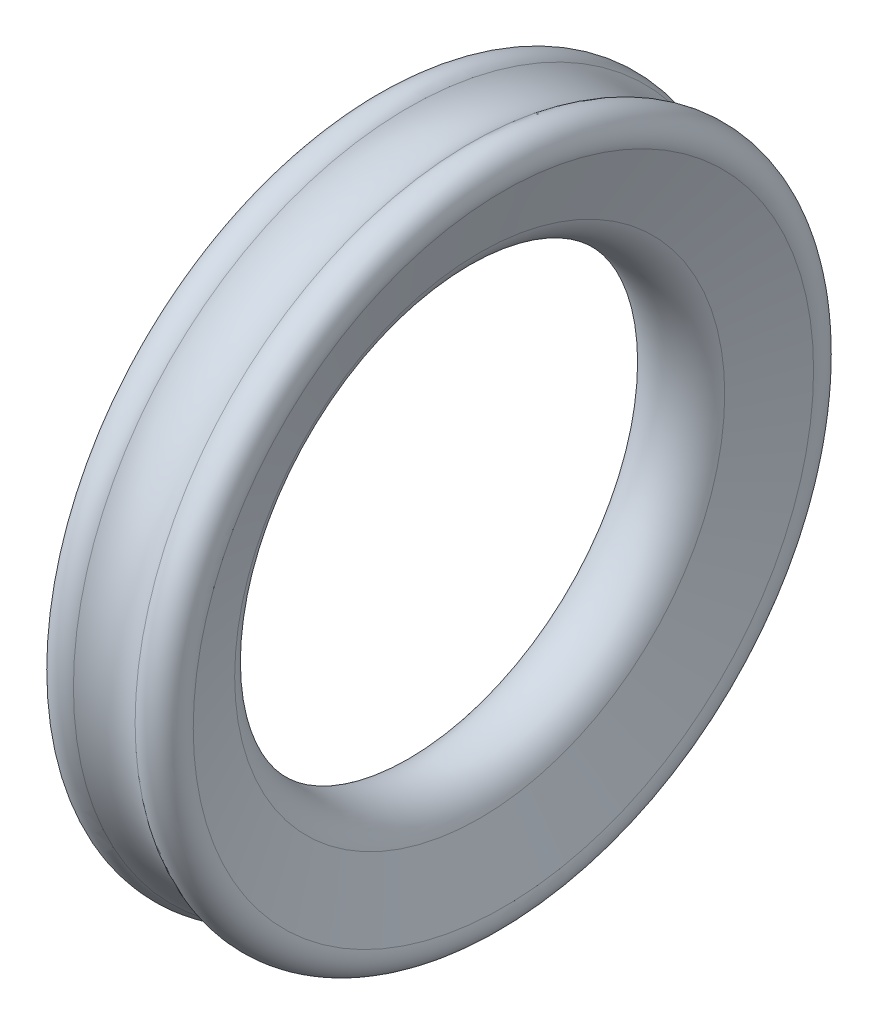
ISO-10303-21;
HEADER;
FILE_DESCRIPTION(('STEP AP214'),'2;1');
FILE_NAME('part.step','',(''),(''),'','','');
FILE_SCHEMA(('AUTOMOTIVE_DESIGN { 1 0 10303 214 1 1 1 1 }'));
ENDSEC;
DATA;
#1=APPLICATION_CONTEXT('core data for automotive mechanical design processes');
#2=APPLICATION_PROTOCOL_DEFINITION('international standard','automotive_design',2000,#1);
#3=PRODUCT_CONTEXT('',#1,'mechanical');
#4=PRODUCT('Part','Part','',(#3));
#5=PRODUCT_RELATED_PRODUCT_CATEGORY('part','',(#4));
#6=PRODUCT_DEFINITION_FORMATION('','',#4);
#7=PRODUCT_DEFINITION_CONTEXT('part definition',#1,'design');
#8=PRODUCT_DEFINITION('design','',#6,#7);
#9=PRODUCT_DEFINITION_SHAPE('','',#8);
#10=(LENGTH_UNIT() NAMED_UNIT(*) SI_UNIT(.MILLI.,.METRE.));
#11=(NAMED_UNIT(*) PLANE_ANGLE_UNIT() SI_UNIT($,.RADIAN.));
#12=(NAMED_UNIT(*) SI_UNIT($,.STERADIAN.) SOLID_ANGLE_UNIT());
#13=UNCERTAINTY_MEASURE_WITH_UNIT(LENGTH_MEASURE(1.E-05),#10,'distance_accuracy_value','');
#14=(GEOMETRIC_REPRESENTATION_CONTEXT(3) GLOBAL_UNCERTAINTY_ASSIGNED_CONTEXT((#13)) GLOBAL_UNIT_ASSIGNED_CONTEXT((#10,
#11,#12)) REPRESENTATION_CONTEXT('',''));
#15=CARTESIAN_POINT('',(0.,0.,0.));
#16=DIRECTION('',(0.,0.,1.));
#17=DIRECTION('',(1.,0.,0.));
#18=AXIS2_PLACEMENT_3D('',#15,#16,#17);
#19=CARTESIAN_POINT('',(0.,0.,0.));
#20=DIRECTION('',(-1.,0.,0.));
#21=DIRECTION('',(0.,0.,1.));
#22=AXIS2_PLACEMENT_3D('',#19,#20,#21);
#23=TOROIDAL_SURFACE('',#22,36.,6.);
#24=CARTESIAN_POINT('',(5.63815572471545,0.,0.));
#25=DIRECTION('',(-1.,0.,0.));
#26=DIRECTION('',(0.,0.,1.));
#27=AXIS2_PLACEMENT_3D('',#24,#25,#26);
#28=CIRCLE('',#27,33.947879140046);
#29=CARTESIAN_POINT('',(5.63815572471545,0.,33.947879140046));
#30=VERTEX_POINT('',#29);
#31=EDGE_CURVE('E10',#30,#30,#28,.T.);
#32=ORIENTED_EDGE('',*,*,#31,.F.);
#33=EDGE_LOOP('',(#32));
#34=FACE_BOUND('',#33,.T.);
#35=CARTESIAN_POINT('',(-5.63815572471545,0.,0.));
#36=DIRECTION('',(-1.,0.,0.));
#37=DIRECTION('',(0.,0.,1.));
#38=AXIS2_PLACEMENT_3D('',#35,#36,#37);
#39=CIRCLE('',#38,33.947879140046);
#40=CARTESIAN_POINT('',(-5.63815572471545,0.,33.947879140046));
#41=VERTEX_POINT('',#40);
#42=EDGE_CURVE('E53',#41,#41,#39,.T.);
#43=ORIENTED_EDGE('',*,*,#42,.T.);
#44=EDGE_LOOP('',(#43));
#45=FACE_BOUND('',#44,.T.);
#46=ADVANCED_FACE('F31',(#34,#45),#23,.T.);
#47=CARTESIAN_POINT('',(5.63815572471545,0.,0.));
#48=DIRECTION('',(1.,0.,0.));
#49=DIRECTION('',(0.,0.,-1.));
#50=AXIS2_PLACEMENT_3D('',#47,#48,#49);
#51=CONICAL_SURFACE('',#50,33.947879140046,1.22173047639603);
#52=CARTESIAN_POINT('',(8.92337305391509,0.,0.));
#53=DIRECTION('',(-1.,0.,0.));
#54=DIRECTION('',(0.,0.,1.));
#55=AXIS2_PLACEMENT_3D('',#52,#53,#54);
#56=CIRCLE('',#55,42.973939570023);
#57=CARTESIAN_POINT('',(8.92337305391509,0.,42.973939570023));
#58=VERTEX_POINT('',#57);
#59=EDGE_CURVE('E37',#58,#58,#56,.T.);
#60=ORIENTED_EDGE('',*,*,#59,.F.);
#61=EDGE_LOOP('',(#60));
#62=FACE_BOUND('',#61,.T.);
#63=ORIENTED_EDGE('',*,*,#31,.T.);
#64=EDGE_LOOP('',(#63));
#65=FACE_BOUND('',#64,.T.);
#66=ADVANCED_FACE('F78',(#62,#65),#51,.F.);
#67=CARTESIAN_POINT('',(6.10429519155737,0.,0.));
#68=DIRECTION('',(-1.,0.,0.));
#69=DIRECTION('',(0.,0.,1.));
#70=AXIS2_PLACEMENT_3D('',#67,#68,#69);
#71=TOROIDAL_SURFACE('',#70,44.,3.);
#72=CARTESIAN_POINT('',(4.27300663409016,0.,0.));
#73=DIRECTION('',(-1.,0.,0.));
#74=DIRECTION('',(0.,0.,1.));
#75=AXIS2_PLACEMENT_3D('',#72,#73,#74);
#76=CIRCLE('',#75,46.376211737049);
#77=CARTESIAN_POINT('',(4.27300663409016,0.,46.376211737049));
#78=VERTEX_POINT('',#77);
#79=EDGE_CURVE('E41',#78,#78,#76,.T.);
#80=ORIENTED_EDGE('',*,*,#79,.F.);
#81=EDGE_LOOP('',(#80));
#82=FACE_BOUND('',#81,.T.);
#83=ORIENTED_EDGE('',*,*,#59,.T.);
#84=EDGE_LOOP('',(#83));
#85=FACE_BOUND('',#84,.T.);
#86=ADVANCED_FACE('F73',(#82,#85),#71,.T.);
#87=CARTESIAN_POINT('',(0.,0.,0.));
#88=DIRECTION('',(-1.,0.,0.));
#89=DIRECTION('',(0.,0.,1.));
#90=AXIS2_PLACEMENT_3D('',#87,#88,#89);
#91=TOROIDAL_SURFACE('',#90,51.9207057901635,7.);
#92=CARTESIAN_POINT('',(-4.27300663409016,0.,0.));
#93=DIRECTION('',(-1.,0.,0.));
#94=DIRECTION('',(0.,0.,1.));
#95=AXIS2_PLACEMENT_3D('',#92,#93,#94);
#96=CIRCLE('',#95,46.376211737049);
#97=CARTESIAN_POINT('',(-4.27300663409016,0.,46.376211737049));
#98=VERTEX_POINT('',#97);
#99=EDGE_CURVE('E45',#98,#98,#96,.T.);
#100=ORIENTED_EDGE('',*,*,#99,.F.);
#101=EDGE_LOOP('',(#100));
#102=FACE_BOUND('',#101,.T.);
#103=ORIENTED_EDGE('',*,*,#79,.T.);
#104=EDGE_LOOP('',(#103));
#105=FACE_BOUND('',#104,.T.);
#106=ADVANCED_FACE('F67',(#102,#105),#91,.F.);
#107=CARTESIAN_POINT('',(-6.10429519155737,0.,0.));
#108=DIRECTION('',(-1.,0.,0.));
#109=DIRECTION('',(0.,0.,1.));
#110=AXIS2_PLACEMENT_3D('',#107,#108,#109);
#111=TOROIDAL_SURFACE('',#110,44.,3.);
#112=CARTESIAN_POINT('',(-8.92337305391509,0.,0.));
#113=DIRECTION('',(-1.,0.,0.));
#114=DIRECTION('',(0.,0.,1.));
#115=AXIS2_PLACEMENT_3D('',#112,#113,#114);
#116=CIRCLE('',#115,42.973939570023);
#117=CARTESIAN_POINT('',(-8.92337305391509,0.,42.973939570023));
#118=VERTEX_POINT('',#117);
#119=EDGE_CURVE('E50',#118,#118,#116,.T.);
#120=ORIENTED_EDGE('',*,*,#119,.F.);
#121=EDGE_LOOP('',(#120));
#122=FACE_BOUND('',#121,.T.);
#123=ORIENTED_EDGE('',*,*,#99,.T.);
#124=EDGE_LOOP('',(#123));
#125=FACE_BOUND('',#124,.T.);
#126=ADVANCED_FACE('F61',(#122,#125),#111,.T.);
#127=CARTESIAN_POINT('',(-8.92337305391509,0.,0.));
#128=DIRECTION('',(-1.,0.,0.));
#129=DIRECTION('',(0.,0.,1.));
#130=AXIS2_PLACEMENT_3D('',#127,#128,#129);
#131=CONICAL_SURFACE('',#130,42.973939570023,1.22173047639603);
#132=ORIENTED_EDGE('',*,*,#42,.F.);
#133=EDGE_LOOP('',(#132));
#134=FACE_BOUND('',#133,.T.);
#135=ORIENTED_EDGE('',*,*,#119,.T.);
#136=EDGE_LOOP('',(#135));
#137=FACE_BOUND('',#136,.T.);
#138=ADVANCED_FACE('F58',(#134,#137),#131,.F.);
#139=CLOSED_SHELL('',(#46,#66,#86,#106,#126,#138));
#140=MANIFOLD_SOLID_BREP('B2',#139);
#141=ADVANCED_BREP_SHAPE_REPRESENTATION('',(#18,#140),#14);
#142=SHAPE_DEFINITION_REPRESENTATION(#9,#141);
ENDSEC;
END-ISO-10303-21;
